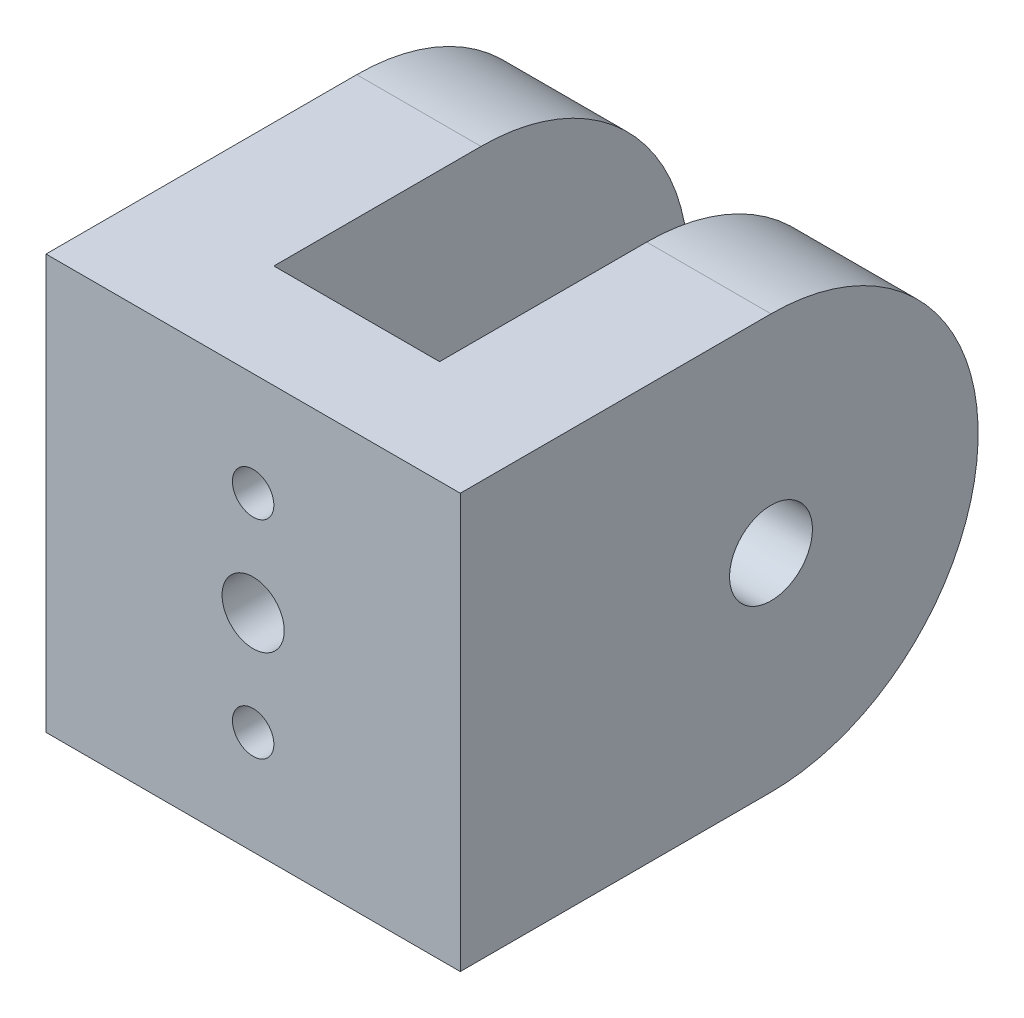
ISO-10303-21;
HEADER;
FILE_DESCRIPTION(('STEP AP214'),'2;1');
FILE_NAME('part.step','',(''),(''),'','','');
FILE_SCHEMA(('AUTOMOTIVE_DESIGN { 1 0 10303 214 1 1 1 1 }'));
ENDSEC;
DATA;
#1=APPLICATION_CONTEXT('core data for automotive mechanical design processes');
#2=APPLICATION_PROTOCOL_DEFINITION('international standard','automotive_design',2000,#1);
#3=PRODUCT_CONTEXT('',#1,'mechanical');
#4=PRODUCT('Part','Part','',(#3));
#5=PRODUCT_RELATED_PRODUCT_CATEGORY('part','',(#4));
#6=PRODUCT_DEFINITION_FORMATION('','',#4);
#7=PRODUCT_DEFINITION_CONTEXT('part definition',#1,'design');
#8=PRODUCT_DEFINITION('design','',#6,#7);
#9=PRODUCT_DEFINITION_SHAPE('','',#8);
#10=(LENGTH_UNIT() NAMED_UNIT(*) SI_UNIT(.MILLI.,.METRE.));
#11=(NAMED_UNIT(*) PLANE_ANGLE_UNIT() SI_UNIT($,.RADIAN.));
#12=(NAMED_UNIT(*) SI_UNIT($,.STERADIAN.) SOLID_ANGLE_UNIT());
#13=UNCERTAINTY_MEASURE_WITH_UNIT(LENGTH_MEASURE(1.E-05),#10,'distance_accuracy_value','');
#14=(GEOMETRIC_REPRESENTATION_CONTEXT(3) GLOBAL_UNCERTAINTY_ASSIGNED_CONTEXT((#13)) GLOBAL_UNIT_ASSIGNED_CONTEXT((#10,
#11,#12)) REPRESENTATION_CONTEXT('',''));
#15=CARTESIAN_POINT('',(0.,0.,0.));
#16=DIRECTION('',(0.,0.,1.));
#17=DIRECTION('',(1.,0.,0.));
#18=AXIS2_PLACEMENT_3D('',#15,#16,#17);
#19=CARTESIAN_POINT('',(53.,40.,-15.));
#20=DIRECTION('',(-1.,0.,0.));
#21=DIRECTION('',(0.,0.,1.));
#22=AXIS2_PLACEMENT_3D('',#19,#20,#21);
#23=CYLINDRICAL_SURFACE('',#22,2.);
#24=CARTESIAN_POINT('',(36.,40.,-15.));
#25=DIRECTION('',(-1.,0.,0.));
#26=DIRECTION('',(0.,0.,1.));
#27=AXIS2_PLACEMENT_3D('',#24,#25,#26);
#28=CIRCLE('',#27,2.);
#29=CARTESIAN_POINT('',(36.,40.,-13.));
#30=VERTEX_POINT('',#29);
#31=EDGE_CURVE('E140',#30,#30,#28,.T.);
#32=ORIENTED_EDGE('',*,*,#31,.F.);
#33=EDGE_LOOP('',(#32));
#34=FACE_BOUND('',#33,.T.);
#35=CARTESIAN_POINT('',(33.,40.,-15.));
#36=DIRECTION('',(-1.,0.,0.));
#37=DIRECTION('',(0.,0.,1.));
#38=AXIS2_PLACEMENT_3D('',#35,#36,#37);
#39=CIRCLE('',#38,2.);
#40=CARTESIAN_POINT('',(33.,40.,-13.));
#41=VERTEX_POINT('',#40);
#42=EDGE_CURVE('E141',#41,#41,#39,.F.);
#43=ORIENTED_EDGE('',*,*,#42,.F.);
#44=EDGE_LOOP('',(#43));
#45=FACE_BOUND('',#44,.T.);
#46=ADVANCED_FACE('F37',(#34,#45),#23,.F.);
#47=CARTESIAN_POINT('',(50.,0.,-5.));
#48=DIRECTION('',(1.,0.,0.));
#49=DIRECTION('',(0.,0.,-1.));
#50=AXIS2_PLACEMENT_3D('',#47,#48,#49);
#51=PLANE('',#50);
#52=CARTESIAN_POINT('',(50.,40.,-15.));
#53=DIRECTION('',(1.,0.,0.));
#54=DIRECTION('',(0.,0.,-1.));
#55=AXIS2_PLACEMENT_3D('',#52,#53,#54);
#56=CIRCLE('',#55,2.);
#57=CARTESIAN_POINT('',(50.,40.,-17.));
#58=VERTEX_POINT('',#57);
#59=EDGE_CURVE('E159',#58,#58,#56,.T.);
#60=ORIENTED_EDGE('',*,*,#59,.F.);
#61=EDGE_LOOP('',(#60));
#62=FACE_BOUND('',#61,.T.);
#63=DIRECTION('',(0.,0.,1.));
#64=VECTOR('',#63,1.);
#65=CARTESIAN_POINT('',(50.,30.,-5.));
#66=LINE('',#65,#64);
#67=CARTESIAN_POINT('',(50.,30.,-15.));
#68=VERTEX_POINT('',#67);
#69=CARTESIAN_POINT('',(50.,30.,0.));
#70=VERTEX_POINT('',#69);
#71=EDGE_CURVE('E46',#68,#70,#66,.T.);
#72=ORIENTED_EDGE('',*,*,#71,.F.);
#73=CARTESIAN_POINT('',(50.,40.,-15.));
#74=DIRECTION('',(1.,0.,0.));
#75=DIRECTION('',(0.,0.,-1.));
#76=AXIS2_PLACEMENT_3D('',#73,#74,#75);
#77=CIRCLE('',#76,10.);
#78=CARTESIAN_POINT('',(50.,50.,-15.));
#79=VERTEX_POINT('',#78);
#80=EDGE_CURVE('E174',#79,#68,#77,.F.);
#81=ORIENTED_EDGE('',*,*,#80,.F.);
#82=DIRECTION('',(0.,0.,1.));
#83=VECTOR('',#82,1.);
#84=CARTESIAN_POINT('',(50.,50.,-5.));
#85=LINE('',#84,#83);
#86=CARTESIAN_POINT('',(50.,50.,0.));
#87=VERTEX_POINT('',#86);
#88=EDGE_CURVE('E11',#79,#87,#85,.T.);
#89=ORIENTED_EDGE('',*,*,#88,.T.);
#90=DIRECTION('',(0.,1.,0.));
#91=VECTOR('',#90,1.);
#92=CARTESIAN_POINT('',(50.,0.,0.));
#93=LINE('',#92,#91);
#94=EDGE_CURVE('E107',#70,#87,#93,.T.);
#95=ORIENTED_EDGE('',*,*,#94,.F.);
#96=EDGE_LOOP('',(#72,#81,#89,#95));
#97=FACE_BOUND('',#96,.T.);
#98=ADVANCED_FACE('F123',(#62,#97),#51,.T.);
#99=CARTESIAN_POINT('',(30.,0.,-5.));
#100=DIRECTION('',(1.,0.,0.));
#101=DIRECTION('',(0.,0.,-1.));
#102=AXIS2_PLACEMENT_3D('',#99,#100,#101);
#103=PLANE('',#102);
#104=CARTESIAN_POINT('',(30.,40.,-15.));
#105=DIRECTION('',(-1.,0.,0.));
#106=DIRECTION('',(0.,0.,1.));
#107=AXIS2_PLACEMENT_3D('',#104,#105,#106);
#108=CIRCLE('',#107,3.5);
#109=CARTESIAN_POINT('',(30.,40.,-11.5));
#110=VERTEX_POINT('',#109);
#111=EDGE_CURVE('E147',#110,#110,#108,.T.);
#112=ORIENTED_EDGE('',*,*,#111,.F.);
#113=EDGE_LOOP('',(#112));
#114=FACE_BOUND('',#113,.T.);
#115=CARTESIAN_POINT('',(30.,40.,-15.));
#116=DIRECTION('',(1.,0.,0.));
#117=DIRECTION('',(0.,0.,1.));
#118=AXIS2_PLACEMENT_3D('',#115,#116,#117);
#119=CIRCLE('',#118,10.);
#120=CARTESIAN_POINT('',(30.,30.,-15.));
#121=VERTEX_POINT('',#120);
#122=CARTESIAN_POINT('',(30.,50.,-15.));
#123=VERTEX_POINT('',#122);
#124=EDGE_CURVE('E162',#121,#123,#119,.T.);
#125=ORIENTED_EDGE('',*,*,#124,.F.);
#126=DIRECTION('',(0.,0.,1.));
#127=VECTOR('',#126,1.);
#128=CARTESIAN_POINT('',(30.,30.,-5.));
#129=LINE('',#128,#127);
#130=CARTESIAN_POINT('',(30.,30.,0.));
#131=VERTEX_POINT('',#130);
#132=EDGE_CURVE('E121',#121,#131,#129,.T.);
#133=ORIENTED_EDGE('',*,*,#132,.T.);
#134=DIRECTION('',(0.,1.,0.));
#135=VECTOR('',#134,1.);
#136=CARTESIAN_POINT('',(30.,0.,0.));
#137=LINE('',#136,#135);
#138=CARTESIAN_POINT('',(30.,50.,0.));
#139=VERTEX_POINT('',#138);
#140=EDGE_CURVE('E109',#131,#139,#137,.T.);
#141=ORIENTED_EDGE('',*,*,#140,.T.);
#142=DIRECTION('',(0.,0.,1.));
#143=VECTOR('',#142,1.);
#144=CARTESIAN_POINT('',(30.,50.,-5.));
#145=LINE('',#144,#143);
#146=EDGE_CURVE('E133',#123,#139,#145,.T.);
#147=ORIENTED_EDGE('',*,*,#146,.F.);
#148=EDGE_LOOP('',(#125,#133,#141,#147));
#149=FACE_BOUND('',#148,.T.);
#150=ADVANCED_FACE('F200',(#114,#149),#103,.F.);
#151=CARTESIAN_POINT('',(36.,30.,-25.));
#152=DIRECTION('',(-1.,0.,0.));
#153=DIRECTION('',(0.,0.,1.));
#154=AXIS2_PLACEMENT_3D('',#151,#152,#153);
#155=PLANE('',#154);
#156=ORIENTED_EDGE('',*,*,#31,.T.);
#157=EDGE_LOOP('',(#156));
#158=FACE_BOUND('',#157,.T.);
#159=DIRECTION('',(0.,0.,1.));
#160=VECTOR('',#159,1.);
#161=CARTESIAN_POINT('',(36.,30.,-25.));
#162=LINE('',#161,#160);
#163=CARTESIAN_POINT('',(36.,30.,-15.));
#164=VERTEX_POINT('',#163);
#165=CARTESIAN_POINT('',(36.,30.,-5.));
#166=VERTEX_POINT('',#165);
#167=EDGE_CURVE('E186',#164,#166,#162,.T.);
#168=ORIENTED_EDGE('',*,*,#167,.F.);
#169=CARTESIAN_POINT('',(36.,40.,-15.));
#170=DIRECTION('',(-1.,0.,0.));
#171=DIRECTION('',(0.,0.,1.));
#172=AXIS2_PLACEMENT_3D('',#169,#170,#171);
#173=CIRCLE('',#172,10.);
#174=CARTESIAN_POINT('',(36.,50.,-15.));
#175=VERTEX_POINT('',#174);
#176=EDGE_CURVE('E54',#164,#175,#173,.F.);
#177=ORIENTED_EDGE('',*,*,#176,.T.);
#178=DIRECTION('',(0.,0.,1.));
#179=VECTOR('',#178,1.);
#180=CARTESIAN_POINT('',(36.,50.,-25.));
#181=LINE('',#180,#179);
#182=CARTESIAN_POINT('',(36.,50.,-5.));
#183=VERTEX_POINT('',#182);
#184=EDGE_CURVE('E59',#175,#183,#181,.T.);
#185=ORIENTED_EDGE('',*,*,#184,.T.);
#186=DIRECTION('',(0.,-1.,0.));
#187=VECTOR('',#186,1.);
#188=CARTESIAN_POINT('',(36.,30.,-5.));
#189=LINE('',#188,#187);
#190=EDGE_CURVE('E184',#183,#166,#189,.T.);
#191=ORIENTED_EDGE('',*,*,#190,.T.);
#192=EDGE_LOOP('',(#168,#177,#185,#191));
#193=FACE_BOUND('',#192,.T.);
#194=ADVANCED_FACE('F197',(#158,#193),#155,.F.);
#195=CARTESIAN_POINT('',(44.,50.,-25.));
#196=DIRECTION('',(1.,0.,0.));
#197=DIRECTION('',(0.,0.,-1.));
#198=AXIS2_PLACEMENT_3D('',#195,#196,#197);
#199=PLANE('',#198);
#200=CARTESIAN_POINT('',(44.,40.,-15.));
#201=DIRECTION('',(1.,0.,0.));
#202=DIRECTION('',(0.,0.,-1.));
#203=AXIS2_PLACEMENT_3D('',#200,#201,#202);
#204=CIRCLE('',#203,2.);
#205=CARTESIAN_POINT('',(44.,40.,-17.));
#206=VERTEX_POINT('',#205);
#207=EDGE_CURVE('E138',#206,#206,#204,.T.);
#208=ORIENTED_EDGE('',*,*,#207,.T.);
#209=EDGE_LOOP('',(#208));
#210=FACE_BOUND('',#209,.T.);
#211=DIRECTION('',(0.,0.,1.));
#212=VECTOR('',#211,1.);
#213=CARTESIAN_POINT('',(44.,50.,-25.));
#214=LINE('',#213,#212);
#215=CARTESIAN_POINT('',(44.,50.,-15.));
#216=VERTEX_POINT('',#215);
#217=CARTESIAN_POINT('',(44.,50.,-5.));
#218=VERTEX_POINT('',#217);
#219=EDGE_CURVE('E182',#216,#218,#214,.T.);
#220=ORIENTED_EDGE('',*,*,#219,.F.);
#221=CARTESIAN_POINT('',(44.,40.,-15.));
#222=DIRECTION('',(1.,0.,0.));
#223=DIRECTION('',(0.,0.,-1.));
#224=AXIS2_PLACEMENT_3D('',#221,#222,#223);
#225=CIRCLE('',#224,10.);
#226=CARTESIAN_POINT('',(44.,30.,-15.));
#227=VERTEX_POINT('',#226);
#228=EDGE_CURVE('E171',#216,#227,#225,.F.);
#229=ORIENTED_EDGE('',*,*,#228,.T.);
#230=DIRECTION('',(0.,0.,1.));
#231=VECTOR('',#230,1.);
#232=CARTESIAN_POINT('',(44.,30.,-25.));
#233=LINE('',#232,#231);
#234=CARTESIAN_POINT('',(44.,30.,-5.));
#235=VERTEX_POINT('',#234);
#236=EDGE_CURVE('E180',#227,#235,#233,.T.);
#237=ORIENTED_EDGE('',*,*,#236,.T.);
#238=DIRECTION('',(0.,1.,0.));
#239=VECTOR('',#238,1.);
#240=CARTESIAN_POINT('',(44.,50.,-5.));
#241=LINE('',#240,#239);
#242=EDGE_CURVE('E177',#235,#218,#241,.T.);
#243=ORIENTED_EDGE('',*,*,#242,.T.);
#244=EDGE_LOOP('',(#220,#229,#237,#243));
#245=FACE_BOUND('',#244,.T.);
#246=ADVANCED_FACE('F199',(#210,#245),#199,.F.);
#247=CARTESIAN_POINT('',(0.,0.,-5.));
#248=DIRECTION('',(0.,0.,-1.));
#249=DIRECTION('',(-1.,0.,0.));
#250=AXIS2_PLACEMENT_3D('',#247,#248,#249);
#251=PLANE('',#250);
#252=CARTESIAN_POINT('',(40.,40.,-5.));
#253=DIRECTION('',(0.,0.,-1.));
#254=DIRECTION('',(-1.,0.,0.));
#255=AXIS2_PLACEMENT_3D('',#252,#253,#254);
#256=CIRCLE('',#255,1.5);
#257=CARTESIAN_POINT('',(38.5,40.,-5.));
#258=VERTEX_POINT('',#257);
#259=EDGE_CURVE('E259',#258,#258,#256,.T.);
#260=ORIENTED_EDGE('',*,*,#259,.F.);
#261=EDGE_LOOP('',(#260));
#262=FACE_BOUND('',#261,.T.);
#263=CARTESIAN_POINT('',(40.,35.,-5.));
#264=DIRECTION('',(0.,0.,-1.));
#265=DIRECTION('',(-1.,0.,0.));
#266=AXIS2_PLACEMENT_3D('',#263,#264,#265);
#267=CIRCLE('',#266,0.999999999999998);
#268=CARTESIAN_POINT('',(39.,35.,-5.));
#269=VERTEX_POINT('',#268);
#270=EDGE_CURVE('E263',#269,#269,#267,.T.);
#271=ORIENTED_EDGE('',*,*,#270,.F.);
#272=EDGE_LOOP('',(#271));
#273=FACE_BOUND('',#272,.T.);
#274=CARTESIAN_POINT('',(40.,45.,-5.));
#275=DIRECTION('',(0.,0.,-1.));
#276=DIRECTION('',(-1.,0.,0.));
#277=AXIS2_PLACEMENT_3D('',#274,#275,#276);
#278=CIRCLE('',#277,0.999999999999998);
#279=CARTESIAN_POINT('',(39.,45.,-5.));
#280=VERTEX_POINT('',#279);
#281=EDGE_CURVE('E152',#280,#280,#278,.T.);
#282=ORIENTED_EDGE('',*,*,#281,.F.);
#283=EDGE_LOOP('',(#282));
#284=FACE_BOUND('',#283,.T.);
#285=DIRECTION('',(1.,0.,0.));
#286=VECTOR('',#285,1.);
#287=CARTESIAN_POINT('',(0.,50.,-5.));
#288=LINE('',#287,#286);
#289=EDGE_CURVE('E132',#183,#218,#288,.T.);
#290=ORIENTED_EDGE('',*,*,#289,.T.);
#291=ORIENTED_EDGE('',*,*,#242,.F.);
#292=DIRECTION('',(1.,0.,0.));
#293=VECTOR('',#292,1.);
#294=CARTESIAN_POINT('',(0.,30.,-5.));
#295=LINE('',#294,#293);
#296=EDGE_CURVE('E136',#166,#235,#295,.T.);
#297=ORIENTED_EDGE('',*,*,#296,.F.);
#298=ORIENTED_EDGE('',*,*,#190,.F.);
#299=EDGE_LOOP('',(#290,#291,#297,#298));
#300=FACE_BOUND('',#299,.T.);
#301=ADVANCED_FACE('F195',(#262,#273,#284,#300),#251,.T.);
#302=CARTESIAN_POINT('',(0.,50.,-5.));
#303=DIRECTION('',(0.,-1.,0.));
#304=DIRECTION('',(0.,0.,-1.));
#305=AXIS2_PLACEMENT_3D('',#302,#303,#304);
#306=PLANE('',#305);
#307=ORIENTED_EDGE('',*,*,#88,.F.);
#308=DIRECTION('',(-1.,0.,0.));
#309=VECTOR('',#308,1.);
#310=CARTESIAN_POINT('',(53.,50.,-15.));
#311=LINE('',#310,#309);
#312=EDGE_CURVE('E168',#79,#216,#311,.T.);
#313=ORIENTED_EDGE('',*,*,#312,.T.);
#314=ORIENTED_EDGE('',*,*,#219,.T.);
#315=ORIENTED_EDGE('',*,*,#289,.F.);
#316=ORIENTED_EDGE('',*,*,#184,.F.);
#317=EDGE_CURVE('E164',#175,#123,#311,.T.);
#318=ORIENTED_EDGE('',*,*,#317,.T.);
#319=ORIENTED_EDGE('',*,*,#146,.T.);
#320=DIRECTION('',(1.,0.,0.));
#321=VECTOR('',#320,1.);
#322=CARTESIAN_POINT('',(0.,50.,0.));
#323=LINE('',#322,#321);
#324=EDGE_CURVE('E126',#139,#87,#323,.T.);
#325=ORIENTED_EDGE('',*,*,#324,.T.);
#326=EDGE_LOOP('',(#307,#313,#314,#315,#316,#318,#319,#325));
#327=FACE_BOUND('',#326,.T.);
#328=ADVANCED_FACE('F39',(#327),#306,.F.);
#329=CARTESIAN_POINT('',(0.,30.,-5.));
#330=DIRECTION('',(0.,-1.,0.));
#331=DIRECTION('',(0.,0.,-1.));
#332=AXIS2_PLACEMENT_3D('',#329,#330,#331);
#333=PLANE('',#332);
#334=DIRECTION('',(-1.,0.,0.));
#335=VECTOR('',#334,1.);
#336=CARTESIAN_POINT('',(53.,30.,-15.));
#337=LINE('',#336,#335);
#338=EDGE_CURVE('E118',#68,#227,#337,.T.);
#339=ORIENTED_EDGE('',*,*,#338,.F.);
#340=ORIENTED_EDGE('',*,*,#71,.T.);
#341=DIRECTION('',(1.,0.,0.));
#342=VECTOR('',#341,1.);
#343=CARTESIAN_POINT('',(0.,30.,0.));
#344=LINE('',#343,#342);
#345=EDGE_CURVE('E103',#131,#70,#344,.T.);
#346=ORIENTED_EDGE('',*,*,#345,.F.);
#347=ORIENTED_EDGE('',*,*,#132,.F.);
#348=EDGE_CURVE('E165',#164,#121,#337,.T.);
#349=ORIENTED_EDGE('',*,*,#348,.F.);
#350=ORIENTED_EDGE('',*,*,#167,.T.);
#351=ORIENTED_EDGE('',*,*,#296,.T.);
#352=ORIENTED_EDGE('',*,*,#236,.F.);
#353=EDGE_LOOP('',(#339,#340,#346,#347,#349,#350,#351,#352));
#354=FACE_BOUND('',#353,.T.);
#355=ADVANCED_FACE('F116',(#354),#333,.T.);
#356=CARTESIAN_POINT('',(53.,40.,-15.));
#357=DIRECTION('',(-1.,0.,0.));
#358=DIRECTION('',(0.,0.,1.));
#359=AXIS2_PLACEMENT_3D('',#356,#357,#358);
#360=CYLINDRICAL_SURFACE('',#359,10.);
#361=ORIENTED_EDGE('',*,*,#80,.T.);
#362=ORIENTED_EDGE('',*,*,#338,.T.);
#363=ORIENTED_EDGE('',*,*,#228,.F.);
#364=ORIENTED_EDGE('',*,*,#312,.F.);
#365=EDGE_LOOP('',(#361,#362,#363,#364));
#366=FACE_BOUND('',#365,.T.);
#367=ADVANCED_FACE('F234',(#366),#360,.T.);
#368=ORIENTED_EDGE('',*,*,#348,.T.);
#369=ORIENTED_EDGE('',*,*,#124,.T.);
#370=ORIENTED_EDGE('',*,*,#317,.F.);
#371=ORIENTED_EDGE('',*,*,#176,.F.);
#372=EDGE_LOOP('',(#368,#369,#370,#371));
#373=FACE_BOUND('',#372,.T.);
#374=ADVANCED_FACE('F226',(#373),#360,.T.);
#375=ORIENTED_EDGE('',*,*,#59,.T.);
#376=EDGE_LOOP('',(#375));
#377=FACE_BOUND('',#376,.T.);
#378=ORIENTED_EDGE('',*,*,#207,.F.);
#379=EDGE_LOOP('',(#378));
#380=FACE_BOUND('',#379,.T.);
#381=ADVANCED_FACE('F215',(#377,#380),#23,.F.);
#382=CARTESIAN_POINT('',(33.,40.,-15.));
#383=DIRECTION('',(-1.,0.,0.));
#384=DIRECTION('',(0.,0.,1.));
#385=AXIS2_PLACEMENT_3D('',#382,#383,#384);
#386=PLANE('',#385);
#387=CARTESIAN_POINT('',(33.,40.,-15.));
#388=DIRECTION('',(-1.,0.,0.));
#389=DIRECTION('',(0.,0.,1.));
#390=AXIS2_PLACEMENT_3D('',#387,#388,#389);
#391=CIRCLE('',#390,3.5);
#392=CARTESIAN_POINT('',(33.,40.,-11.5));
#393=VERTEX_POINT('',#392);
#394=EDGE_CURVE('E143',#393,#393,#391,.T.);
#395=ORIENTED_EDGE('',*,*,#394,.T.);
#396=EDGE_LOOP('',(#395));
#397=FACE_BOUND('',#396,.T.);
#398=ORIENTED_EDGE('',*,*,#42,.T.);
#399=EDGE_LOOP('',(#398));
#400=FACE_BOUND('',#399,.T.);
#401=ADVANCED_FACE('F225',(#397,#400),#386,.T.);
#402=CARTESIAN_POINT('',(33.,40.,-15.));
#403=DIRECTION('',(-1.,0.,0.));
#404=DIRECTION('',(0.,0.,1.));
#405=AXIS2_PLACEMENT_3D('',#402,#403,#404);
#406=CYLINDRICAL_SURFACE('',#405,3.5);
#407=ORIENTED_EDGE('',*,*,#394,.F.);
#408=EDGE_LOOP('',(#407));
#409=FACE_BOUND('',#408,.T.);
#410=ORIENTED_EDGE('',*,*,#111,.T.);
#411=EDGE_LOOP('',(#410));
#412=FACE_BOUND('',#411,.T.);
#413=ADVANCED_FACE('F232',(#409,#412),#406,.F.);
#414=CARTESIAN_POINT('',(40.,45.,13.));
#415=DIRECTION('',(0.,0.,-1.));
#416=DIRECTION('',(-1.,0.,0.));
#417=AXIS2_PLACEMENT_3D('',#414,#415,#416);
#418=CYLINDRICAL_SURFACE('',#417,0.999999999999998);
#419=CARTESIAN_POINT('',(40.,45.,0.));
#420=DIRECTION('',(0.,0.,-1.));
#421=DIRECTION('',(-1.,0.,0.));
#422=AXIS2_PLACEMENT_3D('',#419,#420,#421);
#423=CIRCLE('',#422,0.999999999999998);
#424=CARTESIAN_POINT('',(39.,45.,0.));
#425=VERTEX_POINT('',#424);
#426=EDGE_CURVE('E268',#425,#425,#423,.F.);
#427=ORIENTED_EDGE('',*,*,#426,.T.);
#428=EDGE_LOOP('',(#427));
#429=FACE_BOUND('',#428,.T.);
#430=ORIENTED_EDGE('',*,*,#281,.T.);
#431=EDGE_LOOP('',(#430));
#432=FACE_BOUND('',#431,.T.);
#433=ADVANCED_FACE('F296',(#429,#432),#418,.F.);
#434=CARTESIAN_POINT('',(40.,35.,13.));
#435=DIRECTION('',(0.,0.,-1.));
#436=DIRECTION('',(-1.,0.,0.));
#437=AXIS2_PLACEMENT_3D('',#434,#435,#436);
#438=CYLINDRICAL_SURFACE('',#437,0.999999999999998);
#439=CARTESIAN_POINT('',(40.,35.,0.));
#440=DIRECTION('',(0.,0.,-1.));
#441=DIRECTION('',(-1.,0.,0.));
#442=AXIS2_PLACEMENT_3D('',#439,#440,#441);
#443=CIRCLE('',#442,0.999999999999998);
#444=CARTESIAN_POINT('',(39.,35.,0.));
#445=VERTEX_POINT('',#444);
#446=EDGE_CURVE('E273',#445,#445,#443,.F.);
#447=ORIENTED_EDGE('',*,*,#446,.T.);
#448=EDGE_LOOP('',(#447));
#449=FACE_BOUND('',#448,.T.);
#450=ORIENTED_EDGE('',*,*,#270,.T.);
#451=EDGE_LOOP('',(#450));
#452=FACE_BOUND('',#451,.T.);
#453=ADVANCED_FACE('F290',(#449,#452),#438,.F.);
#454=CARTESIAN_POINT('',(40.,40.,13.));
#455=DIRECTION('',(0.,0.,-1.));
#456=DIRECTION('',(-1.,0.,0.));
#457=AXIS2_PLACEMENT_3D('',#454,#455,#456);
#458=CYLINDRICAL_SURFACE('',#457,1.5);
#459=CARTESIAN_POINT('',(40.,40.,0.));
#460=DIRECTION('',(0.,0.,-1.));
#461=DIRECTION('',(-1.,0.,0.));
#462=AXIS2_PLACEMENT_3D('',#459,#460,#461);
#463=CIRCLE('',#462,1.5);
#464=CARTESIAN_POINT('',(38.5,40.,0.));
#465=VERTEX_POINT('',#464);
#466=EDGE_CURVE('E41',#465,#465,#463,.F.);
#467=ORIENTED_EDGE('',*,*,#466,.T.);
#468=EDGE_LOOP('',(#467));
#469=FACE_BOUND('',#468,.T.);
#470=ORIENTED_EDGE('',*,*,#259,.T.);
#471=EDGE_LOOP('',(#470));
#472=FACE_BOUND('',#471,.T.);
#473=ADVANCED_FACE('F280',(#469,#472),#458,.F.);
#474=CARTESIAN_POINT('',(39.654791549296,38.6565369871619,0.));
#475=DIRECTION('',(0.,0.,-1.));
#476=DIRECTION('',(-1.,0.,0.));
#477=AXIS2_PLACEMENT_3D('',#474,#475,#476);
#478=PLANE('',#477);
#479=ORIENTED_EDGE('',*,*,#426,.F.);
#480=EDGE_LOOP('',(#479));
#481=FACE_BOUND('',#480,.T.);
#482=ORIENTED_EDGE('',*,*,#466,.F.);
#483=EDGE_LOOP('',(#482));
#484=FACE_BOUND('',#483,.T.);
#485=ORIENTED_EDGE('',*,*,#446,.F.);
#486=EDGE_LOOP('',(#485));
#487=FACE_BOUND('',#486,.T.);
#488=ORIENTED_EDGE('',*,*,#140,.F.);
#489=ORIENTED_EDGE('',*,*,#345,.T.);
#490=ORIENTED_EDGE('',*,*,#94,.T.);
#491=ORIENTED_EDGE('',*,*,#324,.F.);
#492=EDGE_LOOP('',(#488,#489,#490,#491));
#493=FACE_BOUND('',#492,.T.);
#494=ADVANCED_FACE('F105',(#481,#484,#487,#493),#478,.F.);
#495=CLOSED_SHELL('',(#46,#98,#150,#194,#246,#301,#328,#355,#367,#374,#381,#401,#413,#433,#453,
#473,#494));
#496=MANIFOLD_SOLID_BREP('B2',#495);
#497=ADVANCED_BREP_SHAPE_REPRESENTATION('',(#18,#496),#14);
#498=SHAPE_DEFINITION_REPRESENTATION(#9,#497);
ENDSEC;
END-ISO-10303-21;
